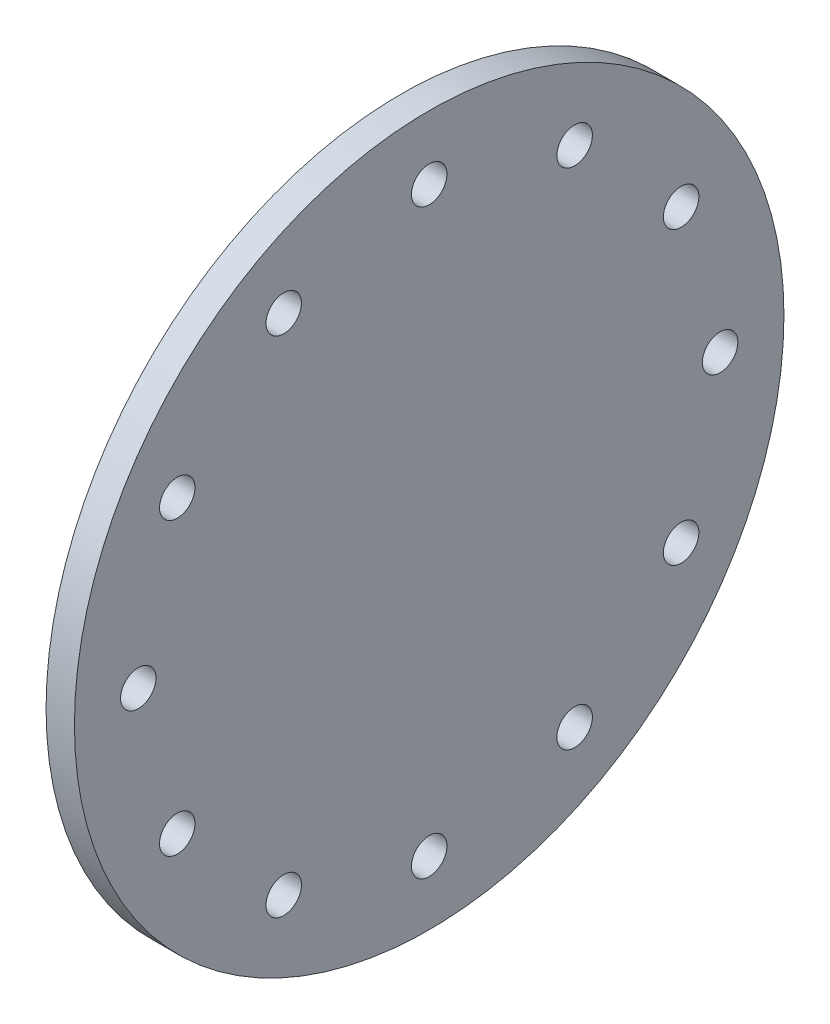
ISO-10303-21;
HEADER;
FILE_DESCRIPTION(('STEP AP214'),'2;1');
FILE_NAME('part.step','',(''),(''),'','','');
FILE_SCHEMA(('AUTOMOTIVE_DESIGN { 1 0 10303 214 1 1 1 1 }'));
ENDSEC;
DATA;
#1=APPLICATION_CONTEXT('core data for automotive mechanical design processes');
#2=APPLICATION_PROTOCOL_DEFINITION('international standard','automotive_design',2000,#1);
#3=PRODUCT_CONTEXT('',#1,'mechanical');
#4=PRODUCT('Part','Part','',(#3));
#5=PRODUCT_RELATED_PRODUCT_CATEGORY('part','',(#4));
#6=PRODUCT_DEFINITION_FORMATION('','',#4);
#7=PRODUCT_DEFINITION_CONTEXT('part definition',#1,'design');
#8=PRODUCT_DEFINITION('design','',#6,#7);
#9=PRODUCT_DEFINITION_SHAPE('','',#8);
#10=(LENGTH_UNIT() NAMED_UNIT(*) SI_UNIT(.MILLI.,.METRE.));
#11=(NAMED_UNIT(*) PLANE_ANGLE_UNIT() SI_UNIT($,.RADIAN.));
#12=(NAMED_UNIT(*) SI_UNIT($,.STERADIAN.) SOLID_ANGLE_UNIT());
#13=UNCERTAINTY_MEASURE_WITH_UNIT(LENGTH_MEASURE(1.E-05),#10,'distance_accuracy_value','');
#14=(GEOMETRIC_REPRESENTATION_CONTEXT(3) GLOBAL_UNCERTAINTY_ASSIGNED_CONTEXT((#13)) GLOBAL_UNIT_ASSIGNED_CONTEXT((#10,
#11,#12)) REPRESENTATION_CONTEXT('',''));
#15=CARTESIAN_POINT('',(0.,0.,0.));
#16=DIRECTION('',(0.,0.,1.));
#17=DIRECTION('',(1.,0.,0.));
#18=AXIS2_PLACEMENT_3D('',#15,#16,#17);
#19=CARTESIAN_POINT('',(200.,0.,0.));
#20=DIRECTION('',(1.,0.,0.));
#21=DIRECTION('',(0.,0.,-1.));
#22=AXIS2_PLACEMENT_3D('',#19,#20,#21);
#23=PLANE('',#22);
#24=CARTESIAN_POINT('',(200.,1775.35207775805,1024.99999999999));
#25=DIRECTION('',(1.,0.,0.));
#26=DIRECTION('',(0.,0.,-1.));
#27=AXIS2_PLACEMENT_3D('',#24,#25,#26);
#28=CIRCLE('',#27,125.00000000005);
#29=CARTESIAN_POINT('',(200.,1775.35207775805,899.999999999939));
#30=VERTEX_POINT('',#29);
#31=EDGE_CURVE('E200',#30,#30,#28,.T.);
#32=ORIENTED_EDGE('',*,*,#31,.F.);
#33=EDGE_LOOP('',(#32));
#34=FACE_BOUND('',#33,.T.);
#35=CARTESIAN_POINT('',(200.,1775.3520777581,-1025.));
#36=DIRECTION('',(1.,0.,0.));
#37=DIRECTION('',(0.,0.,-1.));
#38=AXIS2_PLACEMENT_3D('',#35,#36,#37);
#39=CIRCLE('',#38,125.);
#40=CARTESIAN_POINT('',(200.,1775.3520777581,-1150.));
#41=VERTEX_POINT('',#40);
#42=EDGE_CURVE('E184',#41,#41,#39,.T.);
#43=ORIENTED_EDGE('',*,*,#42,.F.);
#44=EDGE_LOOP('',(#43));
#45=FACE_BOUND('',#44,.T.);
#46=CARTESIAN_POINT('',(200.,8.70201776077545E-11,-2050.00000000009));
#47=DIRECTION('',(1.,0.,0.));
#48=DIRECTION('',(0.,0.,-1.));
#49=AXIS2_PLACEMENT_3D('',#46,#47,#48);
#50=CIRCLE('',#49,125.000000000065);
#51=CARTESIAN_POINT('',(200.,8.70201776077545E-11,-2175.00000000015));
#52=VERTEX_POINT('',#51);
#53=EDGE_CURVE('E168',#52,#52,#50,.T.);
#54=ORIENTED_EDGE('',*,*,#53,.F.);
#55=EDGE_LOOP('',(#54));
#56=FACE_BOUND('',#55,.T.);
#57=CARTESIAN_POINT('',(200.,-1024.99999999992,-1775.35207775823));
#58=DIRECTION('',(1.,0.,0.));
#59=DIRECTION('',(0.,0.,-1.));
#60=AXIS2_PLACEMENT_3D('',#57,#58,#59);
#61=CIRCLE('',#60,125.000000000113);
#62=CARTESIAN_POINT('',(200.,-1024.99999999992,-1900.35207775834));
#63=VERTEX_POINT('',#62);
#64=EDGE_CURVE('E152',#63,#63,#61,.T.);
#65=ORIENTED_EDGE('',*,*,#64,.F.);
#66=EDGE_LOOP('',(#65));
#67=FACE_BOUND('',#66,.T.);
#68=CARTESIAN_POINT('',(200.,-1775.35207775814,1024.99999999984));
#69=DIRECTION('',(1.,0.,0.));
#70=DIRECTION('',(0.,0.,-1.));
#71=AXIS2_PLACEMENT_3D('',#68,#69,#70);
#72=CIRCLE('',#71,125.000000000185);
#73=CARTESIAN_POINT('',(200.,-1775.35207775814,899.999999999652));
#74=VERTEX_POINT('',#73);
#75=EDGE_CURVE('E136',#74,#74,#72,.T.);
#76=ORIENTED_EDGE('',*,*,#75,.F.);
#77=EDGE_LOOP('',(#76));
#78=FACE_BOUND('',#77,.T.);
#79=CARTESIAN_POINT('',(200.,-8.72712302015797E-11,2049.99999999991));
#80=DIRECTION('',(1.,0.,0.));
#81=DIRECTION('',(0.,0.,-1.));
#82=AXIS2_PLACEMENT_3D('',#79,#80,#81);
#83=CIRCLE('',#82,125.000000000129);
#84=CARTESIAN_POINT('',(200.,-8.72712302015797E-11,1924.99999999978));
#85=VERTEX_POINT('',#84);
#86=EDGE_CURVE('E122',#85,#85,#83,.T.);
#87=ORIENTED_EDGE('',*,*,#86,.F.);
#88=EDGE_LOOP('',(#87));
#89=FACE_BOUND('',#88,.T.);
#90=CARTESIAN_POINT('',(200.,0.,0.));
#91=DIRECTION('',(1.,0.,0.));
#92=DIRECTION('',(0.,0.,-1.));
#93=AXIS2_PLACEMENT_3D('',#90,#91,#92);
#94=CIRCLE('',#93,2500.);
#95=CARTESIAN_POINT('',(200.,0.,-2500.));
#96=VERTEX_POINT('',#95);
#97=EDGE_CURVE('E11',#96,#96,#94,.T.);
#98=ORIENTED_EDGE('',*,*,#97,.T.);
#99=EDGE_LOOP('',(#98));
#100=FACE_BOUND('',#99,.T.);
#101=CARTESIAN_POINT('',(200.,-1025.00000000008,1775.35207775797));
#102=DIRECTION('',(1.,0.,0.));
#103=DIRECTION('',(0.,0.,-1.));
#104=AXIS2_PLACEMENT_3D('',#101,#102,#103);
#105=CIRCLE('',#104,125.000000000165);
#106=CARTESIAN_POINT('',(200.,-1025.00000000008,1650.3520777578));
#107=VERTEX_POINT('',#106);
#108=EDGE_CURVE('E128',#107,#107,#105,.T.);
#109=ORIENTED_EDGE('',*,*,#108,.F.);
#110=EDGE_LOOP('',(#109));
#111=FACE_BOUND('',#110,.T.);
#112=CARTESIAN_POINT('',(200.,-2050.,-1.74040355215509E-10));
#113=DIRECTION('',(1.,0.,0.));
#114=DIRECTION('',(0.,0.,-1.));
#115=AXIS2_PLACEMENT_3D('',#112,#113,#114);
#116=CIRCLE('',#115,125.00000000018);
#117=CARTESIAN_POINT('',(200.,-2050.,-125.000000000354));
#118=VERTEX_POINT('',#117);
#119=EDGE_CURVE('E144',#118,#118,#116,.T.);
#120=ORIENTED_EDGE('',*,*,#119,.F.);
#121=EDGE_LOOP('',(#120));
#122=FACE_BOUND('',#121,.T.);
#123=CARTESIAN_POINT('',(200.,-1775.35207775806,-1025.00000000016));
#124=DIRECTION('',(1.,0.,0.));
#125=DIRECTION('',(0.,0.,-1.));
#126=AXIS2_PLACEMENT_3D('',#123,#124,#125);
#127=CIRCLE('',#126,125.000000000154);
#128=CARTESIAN_POINT('',(200.,-1775.35207775806,-1150.00000000032));
#129=VERTEX_POINT('',#128);
#130=EDGE_CURVE('E160',#129,#129,#127,.T.);
#131=ORIENTED_EDGE('',*,*,#130,.F.);
#132=EDGE_LOOP('',(#131));
#133=FACE_BOUND('',#132,.T.);
#134=CARTESIAN_POINT('',(200.,1025.00000000008,-1775.35207775814));
#135=DIRECTION('',(1.,0.,0.));
#136=DIRECTION('',(0.,0.,-1.));
#137=AXIS2_PLACEMENT_3D('',#134,#135,#136);
#138=CIRCLE('',#137,125.000000000025);
#139=CARTESIAN_POINT('',(200.,1025.00000000008,-1900.35207775817));
#140=VERTEX_POINT('',#139);
#141=EDGE_CURVE('E176',#140,#140,#138,.T.);
#142=ORIENTED_EDGE('',*,*,#141,.F.);
#143=EDGE_LOOP('',(#142));
#144=FACE_BOUND('',#143,.T.);
#145=CARTESIAN_POINT('',(200.,2050.,0.));
#146=DIRECTION('',(1.,0.,0.));
#147=DIRECTION('',(0.,0.,-1.));
#148=AXIS2_PLACEMENT_3D('',#145,#146,#147);
#149=CIRCLE('',#148,125.);
#150=CARTESIAN_POINT('',(200.,2050.,-125.));
#151=VERTEX_POINT('',#150);
#152=EDGE_CURVE('E192',#151,#151,#149,.T.);
#153=ORIENTED_EDGE('',*,*,#152,.F.);
#154=EDGE_LOOP('',(#153));
#155=FACE_BOUND('',#154,.T.);
#156=CARTESIAN_POINT('',(200.,1024.99999999992,1775.35207775806));
#157=DIRECTION('',(1.,0.,0.));
#158=DIRECTION('',(0.,0.,-1.));
#159=AXIS2_PLACEMENT_3D('',#156,#157,#158);
#160=CIRCLE('',#159,125.000000000088);
#161=CARTESIAN_POINT('',(200.,1024.99999999992,1650.35207775797));
#162=VERTEX_POINT('',#161);
#163=EDGE_CURVE('E208',#162,#162,#160,.T.);
#164=ORIENTED_EDGE('',*,*,#163,.F.);
#165=EDGE_LOOP('',(#164));
#166=FACE_BOUND('',#165,.T.);
#167=ADVANCED_FACE('F109',(#34,#45,#56,#67,#78,#89,#100,#111,#122,#133,#144,#155,#166),#23,.T.);
#168=CARTESIAN_POINT('',(0.,0.,0.));
#169=DIRECTION('',(1.,0.,0.));
#170=DIRECTION('',(0.,0.,-1.));
#171=AXIS2_PLACEMENT_3D('',#168,#169,#170);
#172=PLANE('',#171);
#173=CARTESIAN_POINT('',(0.,0.,0.));
#174=DIRECTION('',(1.,0.,0.));
#175=DIRECTION('',(0.,0.,-1.));
#176=AXIS2_PLACEMENT_3D('',#173,#174,#175);
#177=CIRCLE('',#176,2500.);
#178=CARTESIAN_POINT('',(0.,0.,-2500.));
#179=VERTEX_POINT('',#178);
#180=EDGE_CURVE('E113',#179,#179,#177,.T.);
#181=ORIENTED_EDGE('',*,*,#180,.F.);
#182=EDGE_LOOP('',(#181));
#183=FACE_BOUND('',#182,.T.);
#184=CARTESIAN_POINT('',(0.,-8.72712302015797E-11,2049.99999999991));
#185=DIRECTION('',(1.,0.,0.));
#186=DIRECTION('',(0.,0.,-1.));
#187=AXIS2_PLACEMENT_3D('',#184,#185,#186);
#188=CIRCLE('',#187,125.000000000129);
#189=CARTESIAN_POINT('',(0.,-8.72712302015797E-11,1924.99999999978));
#190=VERTEX_POINT('',#189);
#191=EDGE_CURVE('E124',#190,#190,#188,.T.);
#192=ORIENTED_EDGE('',*,*,#191,.T.);
#193=EDGE_LOOP('',(#192));
#194=FACE_BOUND('',#193,.T.);
#195=CARTESIAN_POINT('',(0.,-1025.00000000008,1775.35207775797));
#196=DIRECTION('',(1.,0.,0.));
#197=DIRECTION('',(0.,0.,-1.));
#198=AXIS2_PLACEMENT_3D('',#195,#196,#197);
#199=CIRCLE('',#198,125.000000000165);
#200=CARTESIAN_POINT('',(0.,-1025.00000000008,1650.3520777578));
#201=VERTEX_POINT('',#200);
#202=EDGE_CURVE('E132',#201,#201,#199,.T.);
#203=ORIENTED_EDGE('',*,*,#202,.T.);
#204=EDGE_LOOP('',(#203));
#205=FACE_BOUND('',#204,.T.);
#206=CARTESIAN_POINT('',(0.,-1775.35207775814,1024.99999999984));
#207=DIRECTION('',(1.,0.,0.));
#208=DIRECTION('',(0.,0.,-1.));
#209=AXIS2_PLACEMENT_3D('',#206,#207,#208);
#210=CIRCLE('',#209,125.000000000185);
#211=CARTESIAN_POINT('',(0.,-1775.35207775814,899.999999999652));
#212=VERTEX_POINT('',#211);
#213=EDGE_CURVE('E140',#212,#212,#210,.T.);
#214=ORIENTED_EDGE('',*,*,#213,.T.);
#215=EDGE_LOOP('',(#214));
#216=FACE_BOUND('',#215,.T.);
#217=CARTESIAN_POINT('',(0.,-2050.,-1.74040355215509E-10));
#218=DIRECTION('',(1.,0.,0.));
#219=DIRECTION('',(0.,0.,-1.));
#220=AXIS2_PLACEMENT_3D('',#217,#218,#219);
#221=CIRCLE('',#220,125.00000000018);
#222=CARTESIAN_POINT('',(0.,-2050.,-125.000000000354));
#223=VERTEX_POINT('',#222);
#224=EDGE_CURVE('E148',#223,#223,#221,.T.);
#225=ORIENTED_EDGE('',*,*,#224,.T.);
#226=EDGE_LOOP('',(#225));
#227=FACE_BOUND('',#226,.T.);
#228=CARTESIAN_POINT('',(0.,-1024.99999999992,-1775.35207775823));
#229=DIRECTION('',(1.,0.,0.));
#230=DIRECTION('',(0.,0.,-1.));
#231=AXIS2_PLACEMENT_3D('',#228,#229,#230);
#232=CIRCLE('',#231,125.000000000113);
#233=CARTESIAN_POINT('',(0.,-1024.99999999992,-1900.35207775834));
#234=VERTEX_POINT('',#233);
#235=EDGE_CURVE('E156',#234,#234,#232,.T.);
#236=ORIENTED_EDGE('',*,*,#235,.T.);
#237=EDGE_LOOP('',(#236));
#238=FACE_BOUND('',#237,.T.);
#239=CARTESIAN_POINT('',(0.,-1775.35207775806,-1025.00000000016));
#240=DIRECTION('',(1.,0.,0.));
#241=DIRECTION('',(0.,0.,-1.));
#242=AXIS2_PLACEMENT_3D('',#239,#240,#241);
#243=CIRCLE('',#242,125.000000000154);
#244=CARTESIAN_POINT('',(0.,-1775.35207775806,-1150.00000000032));
#245=VERTEX_POINT('',#244);
#246=EDGE_CURVE('E164',#245,#245,#243,.T.);
#247=ORIENTED_EDGE('',*,*,#246,.T.);
#248=EDGE_LOOP('',(#247));
#249=FACE_BOUND('',#248,.T.);
#250=CARTESIAN_POINT('',(0.,8.70201776077545E-11,-2050.00000000009));
#251=DIRECTION('',(1.,0.,0.));
#252=DIRECTION('',(0.,0.,-1.));
#253=AXIS2_PLACEMENT_3D('',#250,#251,#252);
#254=CIRCLE('',#253,125.000000000065);
#255=CARTESIAN_POINT('',(0.,8.70201776077545E-11,-2175.00000000015));
#256=VERTEX_POINT('',#255);
#257=EDGE_CURVE('E172',#256,#256,#254,.T.);
#258=ORIENTED_EDGE('',*,*,#257,.T.);
#259=EDGE_LOOP('',(#258));
#260=FACE_BOUND('',#259,.T.);
#261=CARTESIAN_POINT('',(0.,1025.00000000008,-1775.35207775814));
#262=DIRECTION('',(1.,0.,0.));
#263=DIRECTION('',(0.,0.,-1.));
#264=AXIS2_PLACEMENT_3D('',#261,#262,#263);
#265=CIRCLE('',#264,125.000000000025);
#266=CARTESIAN_POINT('',(0.,1025.00000000008,-1900.35207775817));
#267=VERTEX_POINT('',#266);
#268=EDGE_CURVE('E180',#267,#267,#265,.T.);
#269=ORIENTED_EDGE('',*,*,#268,.T.);
#270=EDGE_LOOP('',(#269));
#271=FACE_BOUND('',#270,.T.);
#272=CARTESIAN_POINT('',(0.,1775.3520777581,-1025.));
#273=DIRECTION('',(1.,0.,0.));
#274=DIRECTION('',(0.,0.,-1.));
#275=AXIS2_PLACEMENT_3D('',#272,#273,#274);
#276=CIRCLE('',#275,125.);
#277=CARTESIAN_POINT('',(0.,1775.3520777581,-1150.));
#278=VERTEX_POINT('',#277);
#279=EDGE_CURVE('E188',#278,#278,#276,.T.);
#280=ORIENTED_EDGE('',*,*,#279,.T.);
#281=EDGE_LOOP('',(#280));
#282=FACE_BOUND('',#281,.T.);
#283=CARTESIAN_POINT('',(0.,2050.,0.));
#284=DIRECTION('',(1.,0.,0.));
#285=DIRECTION('',(0.,0.,-1.));
#286=AXIS2_PLACEMENT_3D('',#283,#284,#285);
#287=CIRCLE('',#286,125.);
#288=CARTESIAN_POINT('',(0.,2050.,-125.));
#289=VERTEX_POINT('',#288);
#290=EDGE_CURVE('E196',#289,#289,#287,.T.);
#291=ORIENTED_EDGE('',*,*,#290,.T.);
#292=EDGE_LOOP('',(#291));
#293=FACE_BOUND('',#292,.T.);
#294=CARTESIAN_POINT('',(0.,1775.35207775805,1024.99999999999));
#295=DIRECTION('',(1.,0.,0.));
#296=DIRECTION('',(0.,0.,-1.));
#297=AXIS2_PLACEMENT_3D('',#294,#295,#296);
#298=CIRCLE('',#297,125.00000000005);
#299=CARTESIAN_POINT('',(0.,1775.35207775805,899.999999999939));
#300=VERTEX_POINT('',#299);
#301=EDGE_CURVE('E204',#300,#300,#298,.T.);
#302=ORIENTED_EDGE('',*,*,#301,.T.);
#303=EDGE_LOOP('',(#302));
#304=FACE_BOUND('',#303,.T.);
#305=CARTESIAN_POINT('',(0.,1024.99999999992,1775.35207775806));
#306=DIRECTION('',(1.,0.,0.));
#307=DIRECTION('',(0.,0.,-1.));
#308=AXIS2_PLACEMENT_3D('',#305,#306,#307);
#309=CIRCLE('',#308,125.000000000088);
#310=CARTESIAN_POINT('',(0.,1024.99999999992,1650.35207775797));
#311=VERTEX_POINT('',#310);
#312=EDGE_CURVE('E212',#311,#311,#309,.T.);
#313=ORIENTED_EDGE('',*,*,#312,.T.);
#314=EDGE_LOOP('',(#313));
#315=FACE_BOUND('',#314,.T.);
#316=ADVANCED_FACE('F224',(#183,#194,#205,#216,#227,#238,#249,#260,#271,#282,#293,#304,#315),
#172,.F.);
#317=CARTESIAN_POINT('',(200.,0.,0.));
#318=DIRECTION('',(-1.,0.,0.));
#319=DIRECTION('',(0.,0.,1.));
#320=AXIS2_PLACEMENT_3D('',#317,#318,#319);
#321=CYLINDRICAL_SURFACE('',#320,2500.);
#322=ORIENTED_EDGE('',*,*,#97,.F.);
#323=EDGE_LOOP('',(#322));
#324=FACE_BOUND('',#323,.T.);
#325=ORIENTED_EDGE('',*,*,#180,.T.);
#326=EDGE_LOOP('',(#325));
#327=FACE_BOUND('',#326,.T.);
#328=ADVANCED_FACE('F111',(#324,#327),#321,.T.);
#329=CARTESIAN_POINT('',(200.,-8.72712302015797E-11,2049.99999999991));
#330=DIRECTION('',(-1.,0.,0.));
#331=DIRECTION('',(0.,0.,1.));
#332=AXIS2_PLACEMENT_3D('',#329,#330,#331);
#333=CYLINDRICAL_SURFACE('',#332,125.000000000129);
#334=ORIENTED_EDGE('',*,*,#86,.T.);
#335=EDGE_LOOP('',(#334));
#336=FACE_BOUND('',#335,.T.);
#337=ORIENTED_EDGE('',*,*,#191,.F.);
#338=EDGE_LOOP('',(#337));
#339=FACE_BOUND('',#338,.T.);
#340=ADVANCED_FACE('F234',(#336,#339),#333,.F.);
#341=CARTESIAN_POINT('',(200.,-1025.00000000008,1775.35207775797));
#342=DIRECTION('',(-1.,0.,0.));
#343=DIRECTION('',(0.,0.,1.));
#344=AXIS2_PLACEMENT_3D('',#341,#342,#343);
#345=CYLINDRICAL_SURFACE('',#344,125.000000000165);
#346=ORIENTED_EDGE('',*,*,#108,.T.);
#347=EDGE_LOOP('',(#346));
#348=FACE_BOUND('',#347,.T.);
#349=ORIENTED_EDGE('',*,*,#202,.F.);
#350=EDGE_LOOP('',(#349));
#351=FACE_BOUND('',#350,.T.);
#352=ADVANCED_FACE('F237',(#348,#351),#345,.F.);
#353=CARTESIAN_POINT('',(200.,-1775.35207775814,1024.99999999984));
#354=DIRECTION('',(-1.,0.,0.));
#355=DIRECTION('',(0.,0.,1.));
#356=AXIS2_PLACEMENT_3D('',#353,#354,#355);
#357=CYLINDRICAL_SURFACE('',#356,125.000000000185);
#358=ORIENTED_EDGE('',*,*,#75,.T.);
#359=EDGE_LOOP('',(#358));
#360=FACE_BOUND('',#359,.T.);
#361=ORIENTED_EDGE('',*,*,#213,.F.);
#362=EDGE_LOOP('',(#361));
#363=FACE_BOUND('',#362,.T.);
#364=ADVANCED_FACE('F241',(#360,#363),#357,.F.);
#365=CARTESIAN_POINT('',(200.,-2050.,-1.74040355215509E-10));
#366=DIRECTION('',(-1.,0.,0.));
#367=DIRECTION('',(0.,0.,1.));
#368=AXIS2_PLACEMENT_3D('',#365,#366,#367);
#369=CYLINDRICAL_SURFACE('',#368,125.00000000018);
#370=ORIENTED_EDGE('',*,*,#119,.T.);
#371=EDGE_LOOP('',(#370));
#372=FACE_BOUND('',#371,.T.);
#373=ORIENTED_EDGE('',*,*,#224,.F.);
#374=EDGE_LOOP('',(#373));
#375=FACE_BOUND('',#374,.T.);
#376=ADVANCED_FACE('F245',(#372,#375),#369,.F.);
#377=CARTESIAN_POINT('',(200.,-1024.99999999992,-1775.35207775823));
#378=DIRECTION('',(-1.,0.,0.));
#379=DIRECTION('',(0.,0.,1.));
#380=AXIS2_PLACEMENT_3D('',#377,#378,#379);
#381=CYLINDRICAL_SURFACE('',#380,125.000000000113);
#382=ORIENTED_EDGE('',*,*,#64,.T.);
#383=EDGE_LOOP('',(#382));
#384=FACE_BOUND('',#383,.T.);
#385=ORIENTED_EDGE('',*,*,#235,.F.);
#386=EDGE_LOOP('',(#385));
#387=FACE_BOUND('',#386,.T.);
#388=ADVANCED_FACE('F249',(#384,#387),#381,.F.);
#389=CARTESIAN_POINT('',(200.,-1775.35207775806,-1025.00000000016));
#390=DIRECTION('',(-1.,0.,0.));
#391=DIRECTION('',(0.,0.,1.));
#392=AXIS2_PLACEMENT_3D('',#389,#390,#391);
#393=CYLINDRICAL_SURFACE('',#392,125.000000000154);
#394=ORIENTED_EDGE('',*,*,#130,.T.);
#395=EDGE_LOOP('',(#394));
#396=FACE_BOUND('',#395,.T.);
#397=ORIENTED_EDGE('',*,*,#246,.F.);
#398=EDGE_LOOP('',(#397));
#399=FACE_BOUND('',#398,.T.);
#400=ADVANCED_FACE('F253',(#396,#399),#393,.F.);
#401=CARTESIAN_POINT('',(200.,8.70201776077545E-11,-2050.00000000009));
#402=DIRECTION('',(-1.,0.,0.));
#403=DIRECTION('',(0.,0.,1.));
#404=AXIS2_PLACEMENT_3D('',#401,#402,#403);
#405=CYLINDRICAL_SURFACE('',#404,125.000000000065);
#406=ORIENTED_EDGE('',*,*,#53,.T.);
#407=EDGE_LOOP('',(#406));
#408=FACE_BOUND('',#407,.T.);
#409=ORIENTED_EDGE('',*,*,#257,.F.);
#410=EDGE_LOOP('',(#409));
#411=FACE_BOUND('',#410,.T.);
#412=ADVANCED_FACE('F257',(#408,#411),#405,.F.);
#413=CARTESIAN_POINT('',(200.,1025.00000000008,-1775.35207775814));
#414=DIRECTION('',(-1.,0.,0.));
#415=DIRECTION('',(0.,0.,1.));
#416=AXIS2_PLACEMENT_3D('',#413,#414,#415);
#417=CYLINDRICAL_SURFACE('',#416,125.000000000025);
#418=ORIENTED_EDGE('',*,*,#141,.T.);
#419=EDGE_LOOP('',(#418));
#420=FACE_BOUND('',#419,.T.);
#421=ORIENTED_EDGE('',*,*,#268,.F.);
#422=EDGE_LOOP('',(#421));
#423=FACE_BOUND('',#422,.T.);
#424=ADVANCED_FACE('F261',(#420,#423),#417,.F.);
#425=CARTESIAN_POINT('',(200.,1775.3520777581,-1025.));
#426=DIRECTION('',(-1.,0.,0.));
#427=DIRECTION('',(0.,0.,1.));
#428=AXIS2_PLACEMENT_3D('',#425,#426,#427);
#429=CYLINDRICAL_SURFACE('',#428,125.);
#430=ORIENTED_EDGE('',*,*,#42,.T.);
#431=EDGE_LOOP('',(#430));
#432=FACE_BOUND('',#431,.T.);
#433=ORIENTED_EDGE('',*,*,#279,.F.);
#434=EDGE_LOOP('',(#433));
#435=FACE_BOUND('',#434,.T.);
#436=ADVANCED_FACE('F265',(#432,#435),#429,.F.);
#437=CARTESIAN_POINT('',(200.,2050.,0.));
#438=DIRECTION('',(-1.,0.,0.));
#439=DIRECTION('',(0.,0.,1.));
#440=AXIS2_PLACEMENT_3D('',#437,#438,#439);
#441=CYLINDRICAL_SURFACE('',#440,125.);
#442=ORIENTED_EDGE('',*,*,#152,.T.);
#443=EDGE_LOOP('',(#442));
#444=FACE_BOUND('',#443,.T.);
#445=ORIENTED_EDGE('',*,*,#290,.F.);
#446=EDGE_LOOP('',(#445));
#447=FACE_BOUND('',#446,.T.);
#448=ADVANCED_FACE('F269',(#444,#447),#441,.F.);
#449=CARTESIAN_POINT('',(200.,1775.35207775805,1024.99999999999));
#450=DIRECTION('',(-1.,0.,0.));
#451=DIRECTION('',(0.,0.,1.));
#452=AXIS2_PLACEMENT_3D('',#449,#450,#451);
#453=CYLINDRICAL_SURFACE('',#452,125.00000000005);
#454=ORIENTED_EDGE('',*,*,#31,.T.);
#455=EDGE_LOOP('',(#454));
#456=FACE_BOUND('',#455,.T.);
#457=ORIENTED_EDGE('',*,*,#301,.F.);
#458=EDGE_LOOP('',(#457));
#459=FACE_BOUND('',#458,.T.);
#460=ADVANCED_FACE('F273',(#456,#459),#453,.F.);
#461=CARTESIAN_POINT('',(200.,1024.99999999992,1775.35207775806));
#462=DIRECTION('',(-1.,0.,0.));
#463=DIRECTION('',(0.,0.,1.));
#464=AXIS2_PLACEMENT_3D('',#461,#462,#463);
#465=CYLINDRICAL_SURFACE('',#464,125.000000000088);
#466=ORIENTED_EDGE('',*,*,#163,.T.);
#467=EDGE_LOOP('',(#466));
#468=FACE_BOUND('',#467,.T.);
#469=ORIENTED_EDGE('',*,*,#312,.F.);
#470=EDGE_LOOP('',(#469));
#471=FACE_BOUND('',#470,.T.);
#472=ADVANCED_FACE('F220',(#468,#471),#465,.F.);
#473=CLOSED_SHELL('',(#167,#316,#328,#340,#352,#364,#376,#388,#400,#412,#424,#436,#448,#460,#472));
#474=MANIFOLD_SOLID_BREP('B2',#473);
#475=ADVANCED_BREP_SHAPE_REPRESENTATION('',(#18,#474),#14);
#476=SHAPE_DEFINITION_REPRESENTATION(#9,#475);
ENDSEC;
END-ISO-10303-21;
